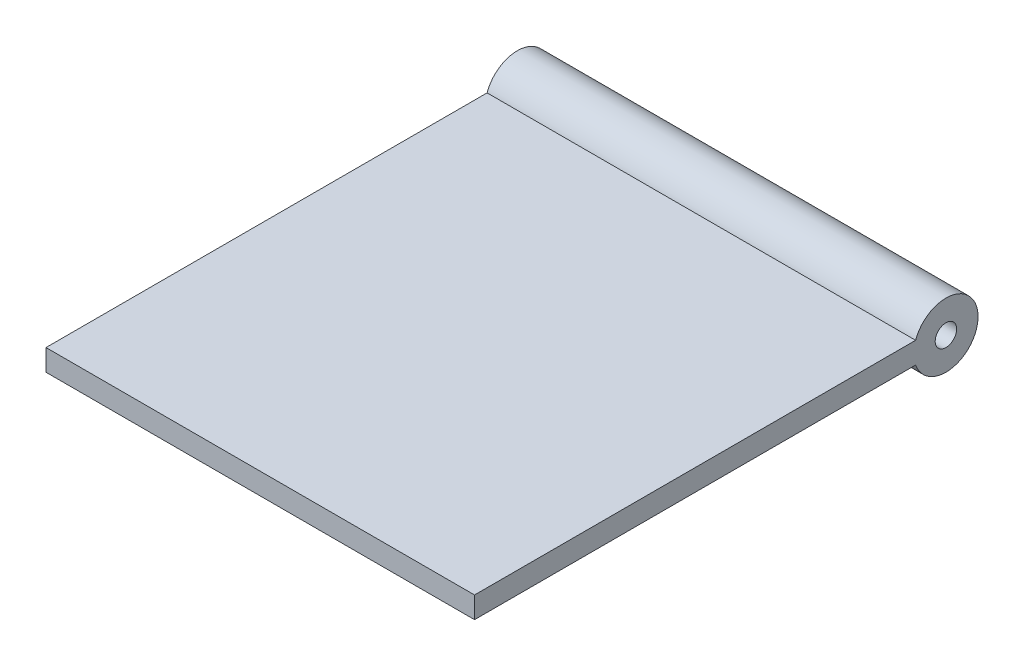
ISO-10303-21;
HEADER;
FILE_DESCRIPTION(('STEP AP214'),'2;1');
FILE_NAME('part.step','',(''),(''),'','','');
FILE_SCHEMA(('AUTOMOTIVE_DESIGN { 1 0 10303 214 1 1 1 1 }'));
ENDSEC;
DATA;
#1=APPLICATION_CONTEXT('core data for automotive mechanical design processes');
#2=APPLICATION_PROTOCOL_DEFINITION('international standard','automotive_design',2000,#1);
#3=PRODUCT_CONTEXT('',#1,'mechanical');
#4=PRODUCT('Part','Part','',(#3));
#5=PRODUCT_RELATED_PRODUCT_CATEGORY('part','',(#4));
#6=PRODUCT_DEFINITION_FORMATION('','',#4);
#7=PRODUCT_DEFINITION_CONTEXT('part definition',#1,'design');
#8=PRODUCT_DEFINITION('design','',#6,#7);
#9=PRODUCT_DEFINITION_SHAPE('','',#8);
#10=(LENGTH_UNIT() NAMED_UNIT(*) SI_UNIT(.MILLI.,.METRE.));
#11=(NAMED_UNIT(*) PLANE_ANGLE_UNIT() SI_UNIT($,.RADIAN.));
#12=(NAMED_UNIT(*) SI_UNIT($,.STERADIAN.) SOLID_ANGLE_UNIT());
#13=UNCERTAINTY_MEASURE_WITH_UNIT(LENGTH_MEASURE(1.E-05),#10,'distance_accuracy_value','');
#14=(GEOMETRIC_REPRESENTATION_CONTEXT(3) GLOBAL_UNCERTAINTY_ASSIGNED_CONTEXT((#13)) GLOBAL_UNIT_ASSIGNED_CONTEXT((#10,
#11,#12)) REPRESENTATION_CONTEXT('',''));
#15=CARTESIAN_POINT('',(0.,0.,0.));
#16=DIRECTION('',(0.,0.,1.));
#17=DIRECTION('',(1.,0.,0.));
#18=AXIS2_PLACEMENT_3D('',#15,#16,#17);
#19=CARTESIAN_POINT('',(100.,0.,0.));
#20=DIRECTION('',(-1.,0.,0.));
#21=DIRECTION('',(0.,0.,1.));
#22=AXIS2_PLACEMENT_3D('',#19,#20,#21);
#23=CYLINDRICAL_SURFACE('',#22,7.5);
#24=CARTESIAN_POINT('',(0.,0.,0.));
#25=DIRECTION('',(1.,0.,0.));
#26=DIRECTION('',(0.,0.,-1.));
#27=AXIS2_PLACEMENT_3D('',#24,#25,#26);
#28=CIRCLE('',#27,7.5);
#29=CARTESIAN_POINT('',(0.,-2.5,7.07106781186548));
#30=VERTEX_POINT('',#29);
#31=CARTESIAN_POINT('',(0.,2.5,7.07106781186548));
#32=VERTEX_POINT('',#31);
#33=EDGE_CURVE('E114',#30,#32,#28,.T.);
#34=ORIENTED_EDGE('',*,*,#33,.T.);
#35=DIRECTION('',(-1.,0.,0.));
#36=VECTOR('',#35,1.);
#37=CARTESIAN_POINT('',(100.,2.5,7.07106781186548));
#38=LINE('',#37,#36);
#39=CARTESIAN_POINT('',(100.,2.5,7.07106781186548));
#40=VERTEX_POINT('',#39);
#41=EDGE_CURVE('E11',#40,#32,#38,.T.);
#42=ORIENTED_EDGE('',*,*,#41,.F.);
#43=CARTESIAN_POINT('',(100.,0.,0.));
#44=DIRECTION('',(1.,0.,0.));
#45=DIRECTION('',(0.,0.,-1.));
#46=AXIS2_PLACEMENT_3D('',#43,#44,#45);
#47=CIRCLE('',#46,7.5);
#48=CARTESIAN_POINT('',(100.,-2.5,7.07106781186548));
#49=VERTEX_POINT('',#48);
#50=EDGE_CURVE('E92',#49,#40,#47,.T.);
#51=ORIENTED_EDGE('',*,*,#50,.F.);
#52=DIRECTION('',(-1.,0.,0.));
#53=VECTOR('',#52,1.);
#54=CARTESIAN_POINT('',(100.,-2.5,7.07106781186548));
#55=LINE('',#54,#53);
#56=EDGE_CURVE('E58',#49,#30,#55,.T.);
#57=ORIENTED_EDGE('',*,*,#56,.T.);
#58=EDGE_LOOP('',(#34,#42,#51,#57));
#59=FACE_BOUND('',#58,.T.);
#60=ADVANCED_FACE('F41',(#59),#23,.T.);
#61=CARTESIAN_POINT('',(100.,2.5,0.));
#62=DIRECTION('',(0.,-1.,0.));
#63=DIRECTION('',(0.,0.,-1.));
#64=AXIS2_PLACEMENT_3D('',#61,#62,#63);
#65=PLANE('',#64);
#66=DIRECTION('',(0.,0.,1.));
#67=VECTOR('',#66,1.);
#68=CARTESIAN_POINT('',(0.,2.5,0.));
#69=LINE('',#68,#67);
#70=CARTESIAN_POINT('',(0.,2.49999999999999,110.));
#71=VERTEX_POINT('',#70);
#72=EDGE_CURVE('E98',#32,#71,#69,.T.);
#73=ORIENTED_EDGE('',*,*,#72,.T.);
#74=DIRECTION('',(-1.,0.,0.));
#75=VECTOR('',#74,1.);
#76=CARTESIAN_POINT('',(100.,2.49999999999999,110.));
#77=LINE('',#76,#75);
#78=CARTESIAN_POINT('',(100.,2.49999999999999,110.));
#79=VERTEX_POINT('',#78);
#80=EDGE_CURVE('E50',#79,#71,#77,.T.);
#81=ORIENTED_EDGE('',*,*,#80,.F.);
#82=DIRECTION('',(0.,0.,1.));
#83=VECTOR('',#82,1.);
#84=CARTESIAN_POINT('',(100.,2.5,0.));
#85=LINE('',#84,#83);
#86=EDGE_CURVE('E84',#40,#79,#85,.T.);
#87=ORIENTED_EDGE('',*,*,#86,.F.);
#88=ORIENTED_EDGE('',*,*,#41,.T.);
#89=EDGE_LOOP('',(#73,#81,#87,#88));
#90=FACE_BOUND('',#89,.T.);
#91=ADVANCED_FACE('F97',(#90),#65,.F.);
#92=CARTESIAN_POINT('',(100.,0.,110.));
#93=DIRECTION('',(0.,0.,-1.));
#94=DIRECTION('',(-1.,0.,0.));
#95=AXIS2_PLACEMENT_3D('',#92,#93,#94);
#96=PLANE('',#95);
#97=DIRECTION('',(0.,-1.,0.));
#98=VECTOR('',#97,1.);
#99=CARTESIAN_POINT('',(0.,0.,110.));
#100=LINE('',#99,#98);
#101=CARTESIAN_POINT('',(0.,-2.50000000000001,110.));
#102=VERTEX_POINT('',#101);
#103=EDGE_CURVE('E119',#71,#102,#100,.T.);
#104=ORIENTED_EDGE('',*,*,#103,.T.);
#105=DIRECTION('',(-1.,0.,0.));
#106=VECTOR('',#105,1.);
#107=CARTESIAN_POINT('',(100.,-2.50000000000001,110.));
#108=LINE('',#107,#106);
#109=CARTESIAN_POINT('',(100.,-2.50000000000001,110.));
#110=VERTEX_POINT('',#109);
#111=EDGE_CURVE('E73',#110,#102,#108,.T.);
#112=ORIENTED_EDGE('',*,*,#111,.F.);
#113=DIRECTION('',(0.,-1.,0.));
#114=VECTOR('',#113,1.);
#115=CARTESIAN_POINT('',(100.,0.,110.));
#116=LINE('',#115,#114);
#117=EDGE_CURVE('E91',#79,#110,#116,.T.);
#118=ORIENTED_EDGE('',*,*,#117,.F.);
#119=ORIENTED_EDGE('',*,*,#80,.T.);
#120=EDGE_LOOP('',(#104,#112,#118,#119));
#121=FACE_BOUND('',#120,.T.);
#122=ADVANCED_FACE('F102',(#121),#96,.F.);
#123=CARTESIAN_POINT('',(100.,-2.5,0.));
#124=DIRECTION('',(0.,-1.,0.));
#125=DIRECTION('',(0.,0.,-1.));
#126=AXIS2_PLACEMENT_3D('',#123,#124,#125);
#127=PLANE('',#126);
#128=DIRECTION('',(0.,0.,1.));
#129=VECTOR('',#128,1.);
#130=CARTESIAN_POINT('',(0.,-2.5,0.));
#131=LINE('',#130,#129);
#132=EDGE_CURVE('E122',#30,#102,#131,.T.);
#133=ORIENTED_EDGE('',*,*,#132,.F.);
#134=ORIENTED_EDGE('',*,*,#56,.F.);
#135=DIRECTION('',(0.,0.,1.));
#136=VECTOR('',#135,1.);
#137=CARTESIAN_POINT('',(100.,-2.5,0.));
#138=LINE('',#137,#136);
#139=EDGE_CURVE('E104',#49,#110,#138,.T.);
#140=ORIENTED_EDGE('',*,*,#139,.T.);
#141=ORIENTED_EDGE('',*,*,#111,.T.);
#142=EDGE_LOOP('',(#133,#134,#140,#141));
#143=FACE_BOUND('',#142,.T.);
#144=ADVANCED_FACE('F140',(#143),#127,.T.);
#145=CARTESIAN_POINT('',(100.,0.,0.));
#146=DIRECTION('',(-1.,0.,0.));
#147=DIRECTION('',(0.,0.,1.));
#148=AXIS2_PLACEMENT_3D('',#145,#146,#147);
#149=CYLINDRICAL_SURFACE('',#148,2.5);
#150=CARTESIAN_POINT('',(100.,0.,0.));
#151=DIRECTION('',(1.,0.,0.));
#152=DIRECTION('',(0.,0.,-1.));
#153=AXIS2_PLACEMENT_3D('',#150,#151,#152);
#154=CIRCLE('',#153,2.5);
#155=CARTESIAN_POINT('',(100.,0.,-2.5));
#156=VERTEX_POINT('',#155);
#157=EDGE_CURVE('E107',#156,#156,#154,.T.);
#158=ORIENTED_EDGE('',*,*,#157,.T.);
#159=EDGE_LOOP('',(#158));
#160=FACE_BOUND('',#159,.T.);
#161=CARTESIAN_POINT('',(0.,0.,0.));
#162=DIRECTION('',(1.,0.,0.));
#163=DIRECTION('',(0.,0.,-1.));
#164=AXIS2_PLACEMENT_3D('',#161,#162,#163);
#165=CIRCLE('',#164,2.5);
#166=CARTESIAN_POINT('',(0.,0.,-2.5));
#167=VERTEX_POINT('',#166);
#168=EDGE_CURVE('E126',#167,#167,#165,.T.);
#169=ORIENTED_EDGE('',*,*,#168,.F.);
#170=EDGE_LOOP('',(#169));
#171=FACE_BOUND('',#170,.T.);
#172=ADVANCED_FACE('F138',(#160,#171),#149,.F.);
#173=CARTESIAN_POINT('',(100.,0.,0.));
#174=DIRECTION('',(1.,0.,0.));
#175=DIRECTION('',(0.,0.,-1.));
#176=AXIS2_PLACEMENT_3D('',#173,#174,#175);
#177=PLANE('',#176);
#178=ORIENTED_EDGE('',*,*,#50,.T.);
#179=ORIENTED_EDGE('',*,*,#86,.T.);
#180=ORIENTED_EDGE('',*,*,#117,.T.);
#181=ORIENTED_EDGE('',*,*,#139,.F.);
#182=EDGE_LOOP('',(#178,#179,#180,#181));
#183=FACE_BOUND('',#182,.T.);
#184=ORIENTED_EDGE('',*,*,#157,.F.);
#185=EDGE_LOOP('',(#184));
#186=FACE_BOUND('',#185,.T.);
#187=ADVANCED_FACE('F87',(#183,#186),#177,.T.);
#188=CARTESIAN_POINT('',(0.,0.,0.));
#189=DIRECTION('',(1.,0.,0.));
#190=DIRECTION('',(0.,0.,-1.));
#191=AXIS2_PLACEMENT_3D('',#188,#189,#190);
#192=PLANE('',#191);
#193=ORIENTED_EDGE('',*,*,#33,.F.);
#194=ORIENTED_EDGE('',*,*,#132,.T.);
#195=ORIENTED_EDGE('',*,*,#103,.F.);
#196=ORIENTED_EDGE('',*,*,#72,.F.);
#197=EDGE_LOOP('',(#193,#194,#195,#196));
#198=FACE_BOUND('',#197,.T.);
#199=ORIENTED_EDGE('',*,*,#168,.T.);
#200=EDGE_LOOP('',(#199));
#201=FACE_BOUND('',#200,.T.);
#202=ADVANCED_FACE('F136',(#198,#201),#192,.F.);
#203=CLOSED_SHELL('',(#60,#91,#122,#144,#172,#187,#202));
#204=MANIFOLD_SOLID_BREP('B2',#203);
#205=ADVANCED_BREP_SHAPE_REPRESENTATION('',(#18,#204),#14);
#206=SHAPE_DEFINITION_REPRESENTATION(#9,#205);
ENDSEC;
END-ISO-10303-21;
